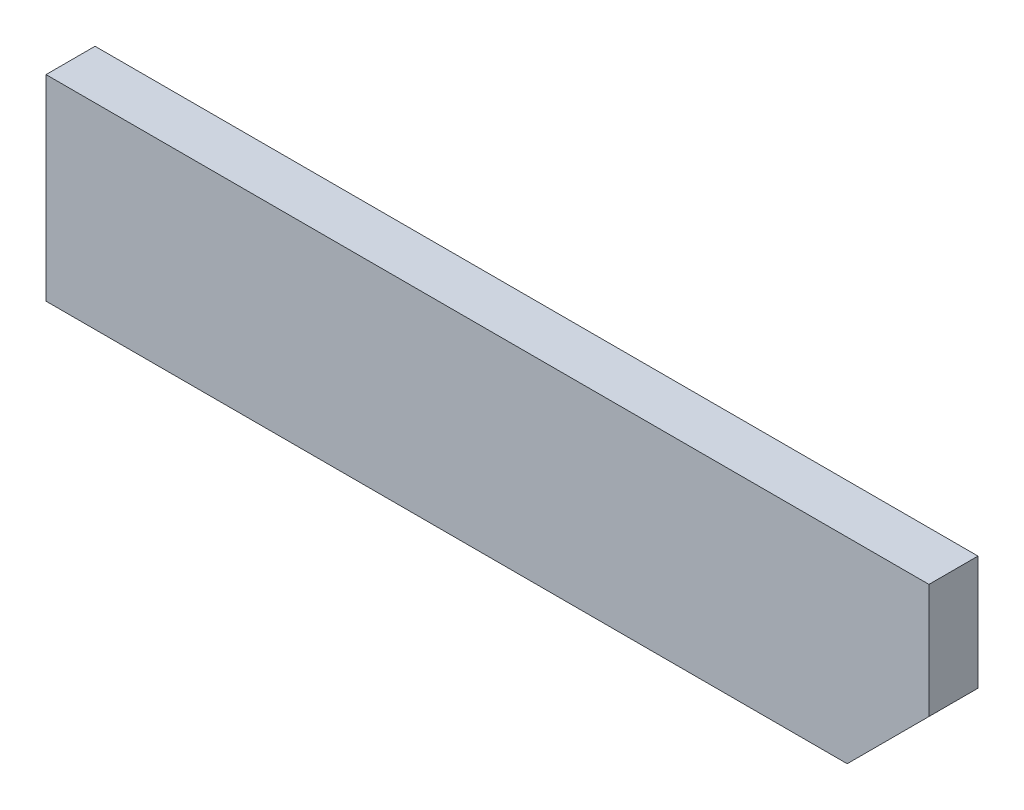
ISO-10303-21;
HEADER;
FILE_DESCRIPTION(('STEP AP214'),'2;1');
FILE_NAME('part.step','',(''),(''),'','','');
FILE_SCHEMA(('AUTOMOTIVE_DESIGN { 1 0 10303 214 1 1 1 1 }'));
ENDSEC;
DATA;
#1=APPLICATION_CONTEXT('core data for automotive mechanical design processes');
#2=APPLICATION_PROTOCOL_DEFINITION('international standard','automotive_design',2000,#1);
#3=PRODUCT_CONTEXT('',#1,'mechanical');
#4=PRODUCT('Part','Part','',(#3));
#5=PRODUCT_RELATED_PRODUCT_CATEGORY('part','',(#4));
#6=PRODUCT_DEFINITION_FORMATION('','',#4);
#7=PRODUCT_DEFINITION_CONTEXT('part definition',#1,'design');
#8=PRODUCT_DEFINITION('design','',#6,#7);
#9=PRODUCT_DEFINITION_SHAPE('','',#8);
#10=(LENGTH_UNIT() NAMED_UNIT(*) SI_UNIT(.MILLI.,.METRE.));
#11=(NAMED_UNIT(*) PLANE_ANGLE_UNIT() SI_UNIT($,.RADIAN.));
#12=(NAMED_UNIT(*) SI_UNIT($,.STERADIAN.) SOLID_ANGLE_UNIT());
#13=UNCERTAINTY_MEASURE_WITH_UNIT(LENGTH_MEASURE(1.E-05),#10,'distance_accuracy_value','');
#14=(GEOMETRIC_REPRESENTATION_CONTEXT(3) GLOBAL_UNCERTAINTY_ASSIGNED_CONTEXT((#13)) GLOBAL_UNIT_ASSIGNED_CONTEXT((#10,
#11,#12)) REPRESENTATION_CONTEXT('',''));
#15=CARTESIAN_POINT('',(0.,0.,0.));
#16=DIRECTION('',(0.,0.,1.));
#17=DIRECTION('',(1.,0.,0.));
#18=AXIS2_PLACEMENT_3D('',#15,#16,#17);
#19=CARTESIAN_POINT('',(-0.06531379843733,0.01758839156451,0.2999994));
#20=DIRECTION('',(0.,0.,1.));
#21=DIRECTION('',(1.,0.,0.));
#22=AXIS2_PLACEMENT_3D('',#19,#20,#21);
#23=PLANE('',#22);
#24=DIRECTION('',(0.707106781186548,0.707106781186548,0.));
#25=VECTOR('',#24,1.);
#26=CARTESIAN_POINT('',(2.20000068,-0.60009024,0.2999994));
#27=LINE('',#26,#25);
#28=CARTESIAN_POINT('',(2.20000068,-0.60009024,0.2999994));
#29=VERTEX_POINT('',#28);
#30=CARTESIAN_POINT('',(2.69999968,-0.10009124,0.2999994));
#31=VERTEX_POINT('',#30);
#32=EDGE_CURVE('E116',#29,#31,#27,.T.);
#33=ORIENTED_EDGE('',*,*,#32,.T.);
#34=DIRECTION('',(0.,1.,0.));
#35=VECTOR('',#34,1.);
#36=CARTESIAN_POINT('',(2.69999968,-0.10009124,0.2999994));
#37=LINE('',#36,#35);
#38=CARTESIAN_POINT('',(2.69999968,0.59993022,0.2999994));
#39=VERTEX_POINT('',#38);
#40=EDGE_CURVE('E99',#31,#39,#37,.T.);
#41=ORIENTED_EDGE('',*,*,#40,.T.);
#42=DIRECTION('',(-0.999999999546883,3.01037072539065E-05,0.));
#43=VECTOR('',#42,1.);
#44=CARTESIAN_POINT('',(2.69999968,0.59993022,0.2999994));
#45=LINE('',#44,#43);
#46=CARTESIAN_POINT('',(-2.69999968,0.60009278,0.2999994));
#47=VERTEX_POINT('',#46);
#48=EDGE_CURVE('E84',#39,#47,#45,.T.);
#49=ORIENTED_EDGE('',*,*,#48,.T.);
#50=DIRECTION('',(0.,-1.,0.));
#51=VECTOR('',#50,1.);
#52=CARTESIAN_POINT('',(-2.69999968,0.60009278,0.2999994));
#53=LINE('',#52,#51);
#54=CARTESIAN_POINT('',(-2.69999968,-0.60009024,0.2999994));
#55=VERTEX_POINT('',#54);
#56=EDGE_CURVE('E89',#47,#55,#53,.T.);
#57=ORIENTED_EDGE('',*,*,#56,.T.);
#58=DIRECTION('',(1.,0.,0.));
#59=VECTOR('',#58,1.);
#60=CARTESIAN_POINT('',(-2.69999968,-0.60009024,0.2999994));
#61=LINE('',#60,#59);
#62=EDGE_CURVE('E11',#55,#29,#61,.T.);
#63=ORIENTED_EDGE('',*,*,#62,.T.);
#64=EDGE_LOOP('',(#33,#41,#49,#57,#63));
#65=FACE_BOUND('',#64,.T.);
#66=ADVANCED_FACE('F16',(#65),#23,.T.);
#67=CARTESIAN_POINT('',(-0.06531379843733,0.01758839156451,0.));
#68=DIRECTION('',(0.,0.,1.));
#69=DIRECTION('',(1.,0.,0.));
#70=AXIS2_PLACEMENT_3D('',#67,#68,#69);
#71=PLANE('',#70);
#72=DIRECTION('',(0.707106781186548,0.707106781186548,0.));
#73=VECTOR('',#72,1.);
#74=CARTESIAN_POINT('',(2.20000068,-0.60009024,0.));
#75=LINE('',#74,#73);
#76=CARTESIAN_POINT('',(2.20000068,-0.60009024,0.));
#77=VERTEX_POINT('',#76);
#78=CARTESIAN_POINT('',(2.69999968,-0.10009124,0.));
#79=VERTEX_POINT('',#78);
#80=EDGE_CURVE('E117',#77,#79,#75,.T.);
#81=ORIENTED_EDGE('',*,*,#80,.F.);
#82=DIRECTION('',(1.,0.,0.));
#83=VECTOR('',#82,1.);
#84=CARTESIAN_POINT('',(-2.69999968,-0.60009024,0.));
#85=LINE('',#84,#83);
#86=CARTESIAN_POINT('',(-2.69999968,-0.60009024,0.));
#87=VERTEX_POINT('',#86);
#88=EDGE_CURVE('E26',#87,#77,#85,.T.);
#89=ORIENTED_EDGE('',*,*,#88,.F.);
#90=DIRECTION('',(0.,-1.,0.));
#91=VECTOR('',#90,1.);
#92=CARTESIAN_POINT('',(-2.69999968,0.60009278,0.));
#93=LINE('',#92,#91);
#94=CARTESIAN_POINT('',(-2.69999968,0.60009278,0.));
#95=VERTEX_POINT('',#94);
#96=EDGE_CURVE('E73',#95,#87,#93,.T.);
#97=ORIENTED_EDGE('',*,*,#96,.F.);
#98=DIRECTION('',(-0.999999999546883,3.01037072539065E-05,0.));
#99=VECTOR('',#98,1.);
#100=CARTESIAN_POINT('',(2.69999968,0.59993022,0.));
#101=LINE('',#100,#99);
#102=CARTESIAN_POINT('',(2.69999968,0.59993022,0.));
#103=VERTEX_POINT('',#102);
#104=EDGE_CURVE('E78',#103,#95,#101,.T.);
#105=ORIENTED_EDGE('',*,*,#104,.F.);
#106=DIRECTION('',(0.,1.,0.));
#107=VECTOR('',#106,1.);
#108=CARTESIAN_POINT('',(2.69999968,-0.10009124,0.));
#109=LINE('',#108,#107);
#110=EDGE_CURVE('E114',#79,#103,#109,.T.);
#111=ORIENTED_EDGE('',*,*,#110,.F.);
#112=EDGE_LOOP('',(#81,#89,#97,#105,#111));
#113=FACE_BOUND('',#112,.T.);
#114=ADVANCED_FACE('F76',(#113),#71,.F.);
#115=CARTESIAN_POINT('',(-2.69999968,-0.60009024,0.));
#116=DIRECTION('',(0.,1.,0.));
#117=DIRECTION('',(1.,0.,0.));
#118=AXIS2_PLACEMENT_3D('',#115,#116,#117);
#119=PLANE('',#118);
#120=DIRECTION('',(0.,0.,1.));
#121=VECTOR('',#120,1.);
#122=CARTESIAN_POINT('',(-2.69999968,-0.60009024,0.));
#123=LINE('',#122,#121);
#124=EDGE_CURVE('E83',#87,#55,#123,.T.);
#125=ORIENTED_EDGE('',*,*,#124,.F.);
#126=ORIENTED_EDGE('',*,*,#88,.T.);
#127=DIRECTION('',(0.,0.,1.));
#128=VECTOR('',#127,1.);
#129=CARTESIAN_POINT('',(2.20000068,-0.60009024,0.));
#130=LINE('',#129,#128);
#131=EDGE_CURVE('E120',#77,#29,#130,.T.);
#132=ORIENTED_EDGE('',*,*,#131,.T.);
#133=ORIENTED_EDGE('',*,*,#62,.F.);
#134=EDGE_LOOP('',(#125,#126,#132,#133));
#135=FACE_BOUND('',#134,.T.);
#136=ADVANCED_FACE('F172',(#135),#119,.F.);
#137=CARTESIAN_POINT('',(-2.69999968,0.60009278,0.));
#138=DIRECTION('',(1.,0.,0.));
#139=DIRECTION('',(0.,1.,0.));
#140=AXIS2_PLACEMENT_3D('',#137,#138,#139);
#141=PLANE('',#140);
#142=DIRECTION('',(0.,0.,1.));
#143=VECTOR('',#142,1.);
#144=CARTESIAN_POINT('',(-2.69999968,0.60009278,0.));
#145=LINE('',#144,#143);
#146=EDGE_CURVE('E87',#95,#47,#145,.T.);
#147=ORIENTED_EDGE('',*,*,#146,.F.);
#148=ORIENTED_EDGE('',*,*,#96,.T.);
#149=ORIENTED_EDGE('',*,*,#124,.T.);
#150=ORIENTED_EDGE('',*,*,#56,.F.);
#151=EDGE_LOOP('',(#147,#148,#149,#150));
#152=FACE_BOUND('',#151,.T.);
#153=ADVANCED_FACE('F88',(#152),#141,.F.);
#154=CARTESIAN_POINT('',(2.69999968,0.59993022,0.));
#155=DIRECTION('',(-3.01037072539065E-05,-0.999999999546883,0.));
#156=DIRECTION('',(-0.999999999546883,3.01037072539065E-05,0.));
#157=AXIS2_PLACEMENT_3D('',#154,#155,#156);
#158=PLANE('',#157);
#159=DIRECTION('',(0.,0.,1.));
#160=VECTOR('',#159,1.);
#161=CARTESIAN_POINT('',(2.69999968,0.59993022,0.));
#162=LINE('',#161,#160);
#163=EDGE_CURVE('E96',#103,#39,#162,.T.);
#164=ORIENTED_EDGE('',*,*,#163,.F.);
#165=ORIENTED_EDGE('',*,*,#104,.T.);
#166=ORIENTED_EDGE('',*,*,#146,.T.);
#167=ORIENTED_EDGE('',*,*,#48,.F.);
#168=EDGE_LOOP('',(#164,#165,#166,#167));
#169=FACE_BOUND('',#168,.T.);
#170=ADVANCED_FACE('F94',(#169),#158,.F.);
#171=CARTESIAN_POINT('',(2.69999968,-0.10009124,0.));
#172=DIRECTION('',(-1.,0.,0.));
#173=DIRECTION('',(0.,0.,1.));
#174=AXIS2_PLACEMENT_3D('',#171,#172,#173);
#175=PLANE('',#174);
#176=DIRECTION('',(0.,0.,1.));
#177=VECTOR('',#176,1.);
#178=CARTESIAN_POINT('',(2.69999968,-0.10009124,0.));
#179=LINE('',#178,#177);
#180=EDGE_CURVE('E19',#79,#31,#179,.T.);
#181=ORIENTED_EDGE('',*,*,#180,.F.);
#182=ORIENTED_EDGE('',*,*,#110,.T.);
#183=ORIENTED_EDGE('',*,*,#163,.T.);
#184=ORIENTED_EDGE('',*,*,#40,.F.);
#185=EDGE_LOOP('',(#181,#182,#183,#184));
#186=FACE_BOUND('',#185,.T.);
#187=ADVANCED_FACE('F143',(#186),#175,.F.);
#188=CARTESIAN_POINT('',(2.20000068,-0.60009024,0.));
#189=DIRECTION('',(-0.707106781186548,0.707106781186548,0.));
#190=DIRECTION('',(0.,0.,1.));
#191=AXIS2_PLACEMENT_3D('',#188,#189,#190);
#192=PLANE('',#191);
#193=ORIENTED_EDGE('',*,*,#131,.F.);
#194=ORIENTED_EDGE('',*,*,#80,.T.);
#195=ORIENTED_EDGE('',*,*,#180,.T.);
#196=ORIENTED_EDGE('',*,*,#32,.F.);
#197=EDGE_LOOP('',(#193,#194,#195,#196));
#198=FACE_BOUND('',#197,.T.);
#199=ADVANCED_FACE('F141',(#198),#192,.F.);
#200=CLOSED_SHELL('',(#66,#114,#136,#153,#170,#187,#199));
#201=MANIFOLD_SOLID_BREP('B1',#200);
#202=ADVANCED_BREP_SHAPE_REPRESENTATION('',(#18,#201),#14);
#203=SHAPE_DEFINITION_REPRESENTATION(#9,#202);
ENDSEC;
END-ISO-10303-21;
